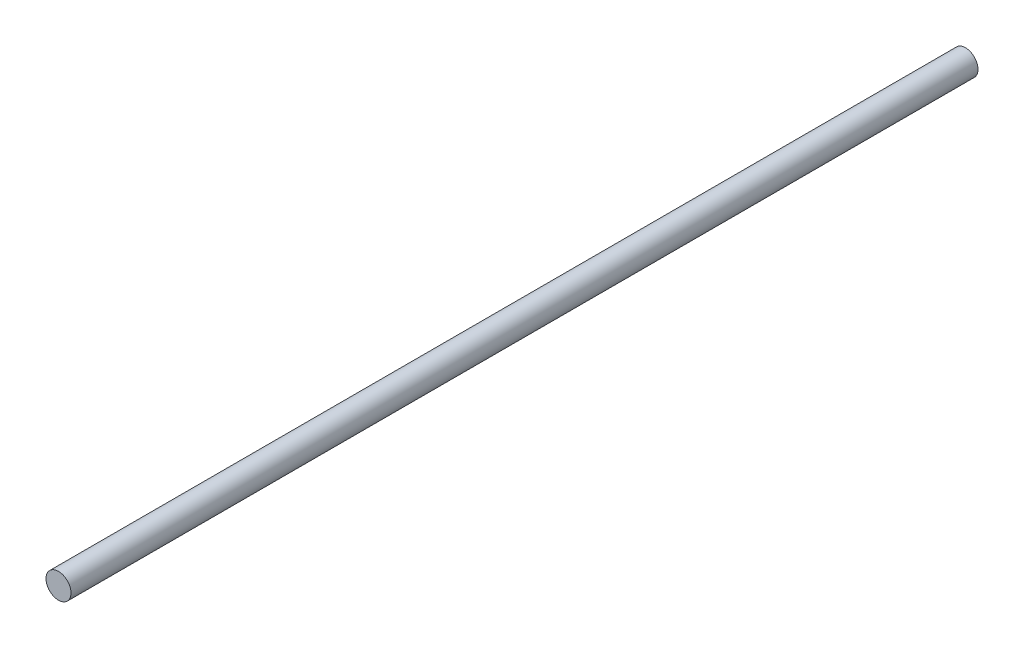
ISO-10303-21;
HEADER;
FILE_DESCRIPTION(('STEP AP214'),'2;1');
FILE_NAME('part.step','',(''),(''),'','','');
FILE_SCHEMA(('AUTOMOTIVE_DESIGN { 1 0 10303 214 1 1 1 1 }'));
ENDSEC;
DATA;
#1=APPLICATION_CONTEXT('core data for automotive mechanical design processes');
#2=APPLICATION_PROTOCOL_DEFINITION('international standard','automotive_design',2000,#1);
#3=PRODUCT_CONTEXT('',#1,'mechanical');
#4=PRODUCT('Part','Part','',(#3));
#5=PRODUCT_RELATED_PRODUCT_CATEGORY('part','',(#4));
#6=PRODUCT_DEFINITION_FORMATION('','',#4);
#7=PRODUCT_DEFINITION_CONTEXT('part definition',#1,'design');
#8=PRODUCT_DEFINITION('design','',#6,#7);
#9=PRODUCT_DEFINITION_SHAPE('','',#8);
#10=(LENGTH_UNIT() NAMED_UNIT(*) SI_UNIT(.MILLI.,.METRE.));
#11=(NAMED_UNIT(*) PLANE_ANGLE_UNIT() SI_UNIT($,.RADIAN.));
#12=(NAMED_UNIT(*) SI_UNIT($,.STERADIAN.) SOLID_ANGLE_UNIT());
#13=UNCERTAINTY_MEASURE_WITH_UNIT(LENGTH_MEASURE(1.E-05),#10,'distance_accuracy_value','');
#14=(GEOMETRIC_REPRESENTATION_CONTEXT(3) GLOBAL_UNCERTAINTY_ASSIGNED_CONTEXT((#13)) GLOBAL_UNIT_ASSIGNED_CONTEXT((#10,
#11,#12)) REPRESENTATION_CONTEXT('',''));
#15=CARTESIAN_POINT('',(0.,0.,0.));
#16=DIRECTION('',(0.,0.,1.));
#17=DIRECTION('',(1.,0.,0.));
#18=AXIS2_PLACEMENT_3D('',#15,#16,#17);
#19=CARTESIAN_POINT('',(0.,0.,0.));
#20=DIRECTION('',(0.,0.,1.));
#21=DIRECTION('',(1.,0.,0.));
#22=AXIS2_PLACEMENT_3D('',#19,#20,#21);
#23=CYLINDRICAL_SURFACE('',#22,4.);
#24=CARTESIAN_POINT('',(0.,0.,290.));
#25=DIRECTION('',(0.,0.,1.));
#26=DIRECTION('',(1.,0.,0.));
#27=AXIS2_PLACEMENT_3D('',#24,#25,#26);
#28=CIRCLE('',#27,4.);
#29=CARTESIAN_POINT('',(4.,0.,290.));
#30=VERTEX_POINT('',#29);
#31=EDGE_CURVE('E10',#30,#30,#28,.T.);
#32=ORIENTED_EDGE('',*,*,#31,.F.);
#33=EDGE_LOOP('',(#32));
#34=FACE_BOUND('',#33,.T.);
#35=CARTESIAN_POINT('',(0.,0.,0.));
#36=DIRECTION('',(0.,0.,-1.));
#37=DIRECTION('',(0.,-1.,0.));
#38=AXIS2_PLACEMENT_3D('',#35,#36,#37);
#39=CIRCLE('',#38,4.);
#40=CARTESIAN_POINT('',(0.,-4.,0.));
#41=VERTEX_POINT('',#40);
#42=EDGE_CURVE('E17',#41,#41,#39,.T.);
#43=ORIENTED_EDGE('',*,*,#42,.F.);
#44=EDGE_LOOP('',(#43));
#45=FACE_BOUND('',#44,.T.);
#46=ADVANCED_FACE('F14',(#34,#45),#23,.T.);
#47=CARTESIAN_POINT('',(0.,0.,290.));
#48=DIRECTION('',(0.,0.,1.));
#49=DIRECTION('',(1.,0.,0.));
#50=AXIS2_PLACEMENT_3D('',#47,#48,#49);
#51=PLANE('',#50);
#52=ORIENTED_EDGE('',*,*,#31,.T.);
#53=EDGE_LOOP('',(#52));
#54=FACE_BOUND('',#53,.T.);
#55=ADVANCED_FACE('F29',(#54),#51,.T.);
#56=CARTESIAN_POINT('',(0.,0.,0.));
#57=DIRECTION('',(0.,0.,1.));
#58=DIRECTION('',(1.,0.,0.));
#59=AXIS2_PLACEMENT_3D('',#56,#57,#58);
#60=PLANE('',#59);
#61=ORIENTED_EDGE('',*,*,#42,.T.);
#62=EDGE_LOOP('',(#61));
#63=FACE_BOUND('',#62,.T.);
#64=ADVANCED_FACE('F26',(#63),#60,.F.);
#65=CLOSED_SHELL('',(#46,#55,#64));
#66=MANIFOLD_SOLID_BREP('B1',#65);
#67=ADVANCED_BREP_SHAPE_REPRESENTATION('',(#18,#66),#14);
#68=SHAPE_DEFINITION_REPRESENTATION(#9,#67);
ENDSEC;
END-ISO-10303-21;
